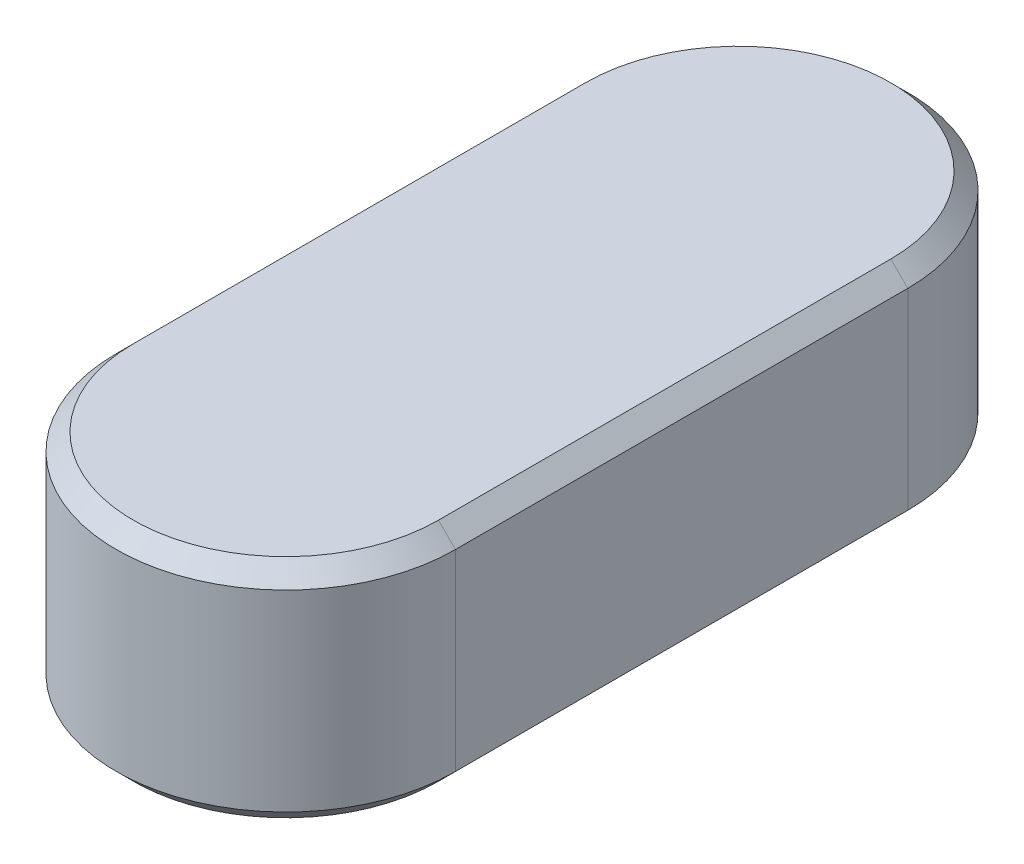
ISO-10303-21;
HEADER;
FILE_DESCRIPTION(('STEP AP214'),'2;1');
FILE_NAME('part.step','',(''),(''),'','','');
FILE_SCHEMA(('AUTOMOTIVE_DESIGN { 1 0 10303 214 1 1 1 1 }'));
ENDSEC;
DATA;
#1=APPLICATION_CONTEXT('core data for automotive mechanical design processes');
#2=APPLICATION_PROTOCOL_DEFINITION('international standard','automotive_design',2000,#1);
#3=PRODUCT_CONTEXT('',#1,'mechanical');
#4=PRODUCT('Part','Part','',(#3));
#5=PRODUCT_RELATED_PRODUCT_CATEGORY('part','',(#4));
#6=PRODUCT_DEFINITION_FORMATION('','',#4);
#7=PRODUCT_DEFINITION_CONTEXT('part definition',#1,'design');
#8=PRODUCT_DEFINITION('design','',#6,#7);
#9=PRODUCT_DEFINITION_SHAPE('','',#8);
#10=(LENGTH_UNIT() NAMED_UNIT(*) SI_UNIT(.MILLI.,.METRE.));
#11=(NAMED_UNIT(*) PLANE_ANGLE_UNIT() SI_UNIT($,.RADIAN.));
#12=(NAMED_UNIT(*) SI_UNIT($,.STERADIAN.) SOLID_ANGLE_UNIT());
#13=UNCERTAINTY_MEASURE_WITH_UNIT(LENGTH_MEASURE(1.E-05),#10,'distance_accuracy_value','');
#14=(GEOMETRIC_REPRESENTATION_CONTEXT(3) GLOBAL_UNCERTAINTY_ASSIGNED_CONTEXT((#13)) GLOBAL_UNIT_ASSIGNED_CONTEXT((#10,
#11,#12)) REPRESENTATION_CONTEXT('',''));
#15=CARTESIAN_POINT('',(0.,0.,0.));
#16=DIRECTION('',(0.,0.,1.));
#17=DIRECTION('',(1.,0.,0.));
#18=AXIS2_PLACEMENT_3D('',#15,#16,#17);
#19=CARTESIAN_POINT('',(0.,8.,0.));
#20=DIRECTION('',(0.,-1.,0.));
#21=DIRECTION('',(0.,0.,-1.));
#22=AXIS2_PLACEMENT_3D('',#19,#20,#21);
#23=CYLINDRICAL_SURFACE('',#22,6.);
#24=DIRECTION('',(0.,-1.,0.));
#25=VECTOR('',#24,1.);
#26=CARTESIAN_POINT('',(-6.,8.,0.));
#27=LINE('',#26,#25);
#28=CARTESIAN_POINT('',(-6.,7.4,0.));
#29=VERTEX_POINT('',#28);
#30=CARTESIAN_POINT('',(-6.,0.600000000000003,0.));
#31=VERTEX_POINT('',#30);
#32=EDGE_CURVE('E119',#29,#31,#27,.T.);
#33=ORIENTED_EDGE('',*,*,#32,.T.);
#34=CARTESIAN_POINT('',(0.,0.600000000000003,0.));
#35=DIRECTION('',(0.,-1.,0.));
#36=DIRECTION('',(0.,0.,-1.));
#37=AXIS2_PLACEMENT_3D('',#34,#35,#36);
#38=CIRCLE('',#37,6.);
#39=CARTESIAN_POINT('',(6.,0.600000000000003,0.));
#40=VERTEX_POINT('',#39);
#41=EDGE_CURVE('E126',#31,#40,#38,.F.);
#42=ORIENTED_EDGE('',*,*,#41,.T.);
#43=DIRECTION('',(0.,-1.,0.));
#44=VECTOR('',#43,1.);
#45=CARTESIAN_POINT('',(6.,8.,0.));
#46=LINE('',#45,#44);
#47=CARTESIAN_POINT('',(6.,7.4,0.));
#48=VERTEX_POINT('',#47);
#49=EDGE_CURVE('E121',#48,#40,#46,.T.);
#50=ORIENTED_EDGE('',*,*,#49,.F.);
#51=CARTESIAN_POINT('',(0.,7.4,0.));
#52=DIRECTION('',(0.,-1.,0.));
#53=DIRECTION('',(0.,0.,-1.));
#54=AXIS2_PLACEMENT_3D('',#51,#52,#53);
#55=CIRCLE('',#54,6.);
#56=EDGE_CURVE('E117',#48,#29,#55,.T.);
#57=ORIENTED_EDGE('',*,*,#56,.T.);
#58=EDGE_LOOP('',(#33,#42,#50,#57));
#59=FACE_BOUND('',#58,.T.);
#60=ADVANCED_FACE('F45',(#59),#23,.T.);
#61=CARTESIAN_POINT('',(6.,8.,0.));
#62=DIRECTION('',(-1.,0.,0.));
#63=DIRECTION('',(0.,0.,1.));
#64=AXIS2_PLACEMENT_3D('',#61,#62,#63);
#65=PLANE('',#64);
#66=ORIENTED_EDGE('',*,*,#49,.T.);
#67=DIRECTION('',(0.,0.,-1.));
#68=VECTOR('',#67,1.);
#69=CARTESIAN_POINT('',(6.,0.600000000000003,-16.));
#70=LINE('',#69,#68);
#71=CARTESIAN_POINT('',(6.,0.600000000000003,-16.));
#72=VERTEX_POINT('',#71);
#73=EDGE_CURVE('E192',#40,#72,#70,.T.);
#74=ORIENTED_EDGE('',*,*,#73,.T.);
#75=DIRECTION('',(0.,-1.,0.));
#76=VECTOR('',#75,1.);
#77=CARTESIAN_POINT('',(6.,8.,-16.));
#78=LINE('',#77,#76);
#79=CARTESIAN_POINT('',(6.,7.4,-16.));
#80=VERTEX_POINT('',#79);
#81=EDGE_CURVE('E233',#80,#72,#78,.T.);
#82=ORIENTED_EDGE('',*,*,#81,.F.);
#83=DIRECTION('',(0.,0.,1.));
#84=VECTOR('',#83,1.);
#85=CARTESIAN_POINT('',(6.,7.4,0.));
#86=LINE('',#85,#84);
#87=EDGE_CURVE('E214',#80,#48,#86,.T.);
#88=ORIENTED_EDGE('',*,*,#87,.T.);
#89=EDGE_LOOP('',(#66,#74,#82,#88));
#90=FACE_BOUND('',#89,.T.);
#91=ADVANCED_FACE('F235',(#90),#65,.F.);
#92=CARTESIAN_POINT('',(0.,8.,-16.));
#93=DIRECTION('',(0.,-1.,0.));
#94=DIRECTION('',(0.,0.,-1.));
#95=AXIS2_PLACEMENT_3D('',#92,#93,#94);
#96=CYLINDRICAL_SURFACE('',#95,6.);
#97=ORIENTED_EDGE('',*,*,#81,.T.);
#98=CARTESIAN_POINT('',(0.,0.600000000000003,-16.));
#99=DIRECTION('',(0.,-1.,0.));
#100=DIRECTION('',(0.,0.,-1.));
#101=AXIS2_PLACEMENT_3D('',#98,#99,#100);
#102=CIRCLE('',#101,6.);
#103=CARTESIAN_POINT('',(-6.,0.600000000000003,-16.));
#104=VERTEX_POINT('',#103);
#105=EDGE_CURVE('E187',#72,#104,#102,.F.);
#106=ORIENTED_EDGE('',*,*,#105,.T.);
#107=DIRECTION('',(0.,-1.,0.));
#108=VECTOR('',#107,1.);
#109=CARTESIAN_POINT('',(-6.,8.,-16.));
#110=LINE('',#109,#108);
#111=CARTESIAN_POINT('',(-6.,7.4,-16.));
#112=VERTEX_POINT('',#111);
#113=EDGE_CURVE('E139',#112,#104,#110,.T.);
#114=ORIENTED_EDGE('',*,*,#113,.F.);
#115=CARTESIAN_POINT('',(0.,7.4,-16.));
#116=DIRECTION('',(0.,-1.,0.));
#117=DIRECTION('',(0.,0.,-1.));
#118=AXIS2_PLACEMENT_3D('',#115,#116,#117);
#119=CIRCLE('',#118,6.);
#120=EDGE_CURVE('E209',#112,#80,#119,.T.);
#121=ORIENTED_EDGE('',*,*,#120,.T.);
#122=EDGE_LOOP('',(#97,#106,#114,#121));
#123=FACE_BOUND('',#122,.T.);
#124=ADVANCED_FACE('F232',(#123),#96,.T.);
#125=CARTESIAN_POINT('',(-6.,8.,0.));
#126=DIRECTION('',(1.,0.,0.));
#127=DIRECTION('',(0.,0.,-1.));
#128=AXIS2_PLACEMENT_3D('',#125,#126,#127);
#129=PLANE('',#128);
#130=ORIENTED_EDGE('',*,*,#113,.T.);
#131=DIRECTION('',(0.,0.,1.));
#132=VECTOR('',#131,1.);
#133=CARTESIAN_POINT('',(-6.,0.600000000000003,0.));
#134=LINE('',#133,#132);
#135=EDGE_CURVE('E137',#104,#31,#134,.T.);
#136=ORIENTED_EDGE('',*,*,#135,.T.);
#137=ORIENTED_EDGE('',*,*,#32,.F.);
#138=DIRECTION('',(0.,0.,-1.));
#139=VECTOR('',#138,1.);
#140=CARTESIAN_POINT('',(-6.,7.4,0.));
#141=LINE('',#140,#139);
#142=EDGE_CURVE('E134',#29,#112,#141,.T.);
#143=ORIENTED_EDGE('',*,*,#142,.T.);
#144=EDGE_LOOP('',(#130,#136,#137,#143));
#145=FACE_BOUND('',#144,.T.);
#146=ADVANCED_FACE('F133',(#145),#129,.F.);
#147=CARTESIAN_POINT('',(0.,8.,0.));
#148=DIRECTION('',(0.,-1.,0.));
#149=DIRECTION('',(0.,0.,-1.));
#150=AXIS2_PLACEMENT_3D('',#147,#148,#149);
#151=PLANE('',#150);
#152=CARTESIAN_POINT('',(0.,8.,-16.));
#153=DIRECTION('',(0.,-1.,0.));
#154=DIRECTION('',(0.,0.,-1.));
#155=AXIS2_PLACEMENT_3D('',#152,#153,#154);
#156=CIRCLE('',#155,5.4);
#157=CARTESIAN_POINT('',(5.4,8.,-16.));
#158=VERTEX_POINT('',#157);
#159=CARTESIAN_POINT('',(-5.4,8.,-16.));
#160=VERTEX_POINT('',#159);
#161=EDGE_CURVE('E71',#158,#160,#156,.F.);
#162=ORIENTED_EDGE('',*,*,#161,.T.);
#163=DIRECTION('',(0.,0.,1.));
#164=VECTOR('',#163,1.);
#165=CARTESIAN_POINT('',(-5.4,8.,0.));
#166=LINE('',#165,#164);
#167=CARTESIAN_POINT('',(-5.4,8.,0.));
#168=VERTEX_POINT('',#167);
#169=EDGE_CURVE('E11',#160,#168,#166,.T.);
#170=ORIENTED_EDGE('',*,*,#169,.T.);
#171=CARTESIAN_POINT('',(0.,8.,0.));
#172=DIRECTION('',(0.,-1.,0.));
#173=DIRECTION('',(0.,0.,-1.));
#174=AXIS2_PLACEMENT_3D('',#171,#172,#173);
#175=CIRCLE('',#174,5.4);
#176=CARTESIAN_POINT('',(5.4,8.,0.));
#177=VERTEX_POINT('',#176);
#178=EDGE_CURVE('E56',#168,#177,#175,.F.);
#179=ORIENTED_EDGE('',*,*,#178,.T.);
#180=DIRECTION('',(0.,0.,-1.));
#181=VECTOR('',#180,1.);
#182=CARTESIAN_POINT('',(5.4,8.,0.));
#183=LINE('',#182,#181);
#184=EDGE_CURVE('E219',#177,#158,#183,.T.);
#185=ORIENTED_EDGE('',*,*,#184,.T.);
#186=EDGE_LOOP('',(#162,#170,#179,#185));
#187=FACE_BOUND('',#186,.T.);
#188=ADVANCED_FACE('F225',(#187),#151,.F.);
#189=CARTESIAN_POINT('',(0.,0.,0.));
#190=DIRECTION('',(0.,-1.,0.));
#191=DIRECTION('',(0.,0.,-1.));
#192=AXIS2_PLACEMENT_3D('',#189,#190,#191);
#193=PLANE('',#192);
#194=CARTESIAN_POINT('',(0.,0.,0.));
#195=DIRECTION('',(0.,-1.,0.));
#196=DIRECTION('',(0.,0.,-1.));
#197=AXIS2_PLACEMENT_3D('',#194,#195,#196);
#198=CIRCLE('',#197,5.4);
#199=CARTESIAN_POINT('',(5.4,0.,0.));
#200=VERTEX_POINT('',#199);
#201=CARTESIAN_POINT('',(-5.4,0.,0.));
#202=VERTEX_POINT('',#201);
#203=EDGE_CURVE('E199',#200,#202,#198,.T.);
#204=ORIENTED_EDGE('',*,*,#203,.T.);
#205=DIRECTION('',(0.,0.,-1.));
#206=VECTOR('',#205,1.);
#207=CARTESIAN_POINT('',(-5.4,0.,-16.));
#208=LINE('',#207,#206);
#209=CARTESIAN_POINT('',(-5.4,0.,-16.));
#210=VERTEX_POINT('',#209);
#211=EDGE_CURVE('E127',#202,#210,#208,.T.);
#212=ORIENTED_EDGE('',*,*,#211,.T.);
#213=CARTESIAN_POINT('',(0.,0.,-16.));
#214=DIRECTION('',(0.,-1.,0.));
#215=DIRECTION('',(0.,0.,-1.));
#216=AXIS2_PLACEMENT_3D('',#213,#214,#215);
#217=CIRCLE('',#216,5.4);
#218=CARTESIAN_POINT('',(5.4,0.,-16.));
#219=VERTEX_POINT('',#218);
#220=EDGE_CURVE('E185',#210,#219,#217,.T.);
#221=ORIENTED_EDGE('',*,*,#220,.T.);
#222=DIRECTION('',(0.,0.,1.));
#223=VECTOR('',#222,1.);
#224=CARTESIAN_POINT('',(5.4,0.,0.));
#225=LINE('',#224,#223);
#226=EDGE_CURVE('E193',#219,#200,#225,.T.);
#227=ORIENTED_EDGE('',*,*,#226,.T.);
#228=EDGE_LOOP('',(#204,#212,#221,#227));
#229=FACE_BOUND('',#228,.T.);
#230=ADVANCED_FACE('F263',(#229),#193,.T.);
#231=CARTESIAN_POINT('',(6.,0.600000000000003,0.));
#232=DIRECTION('',(0.707106781186548,-0.707106781186548,0.));
#233=DIRECTION('',(0.,0.,1.));
#234=AXIS2_PLACEMENT_3D('',#231,#232,#233);
#235=PLANE('',#234);
#236=DIRECTION('',(0.707106781186548,0.707106781186548,0.));
#237=VECTOR('',#236,1.);
#238=CARTESIAN_POINT('',(5.4,0.,0.));
#239=LINE('',#238,#237);
#240=EDGE_CURVE('E169',#200,#40,#239,.T.);
#241=ORIENTED_EDGE('',*,*,#240,.F.);
#242=ORIENTED_EDGE('',*,*,#226,.F.);
#243=DIRECTION('',(-0.707106781186548,-0.707106781186548,0.));
#244=VECTOR('',#243,1.);
#245=CARTESIAN_POINT('',(6.,0.600000000000003,-16.));
#246=LINE('',#245,#244);
#247=EDGE_CURVE('E140',#72,#219,#246,.T.);
#248=ORIENTED_EDGE('',*,*,#247,.F.);
#249=ORIENTED_EDGE('',*,*,#73,.F.);
#250=EDGE_LOOP('',(#241,#242,#248,#249));
#251=FACE_BOUND('',#250,.T.);
#252=ADVANCED_FACE('F191',(#251),#235,.T.);
#253=CARTESIAN_POINT('',(0.,0.600000000000003,-16.));
#254=DIRECTION('',(0.,1.,0.));
#255=DIRECTION('',(0.,0.,1.));
#256=AXIS2_PLACEMENT_3D('',#253,#254,#255);
#257=CONICAL_SURFACE('',#256,6.,0.785398163397448);
#258=ORIENTED_EDGE('',*,*,#247,.T.);
#259=ORIENTED_EDGE('',*,*,#220,.F.);
#260=DIRECTION('',(0.707106781186548,-0.707106781186548,0.));
#261=VECTOR('',#260,1.);
#262=CARTESIAN_POINT('',(-6.,0.600000000000003,-16.));
#263=LINE('',#262,#261);
#264=EDGE_CURVE('E162',#104,#210,#263,.T.);
#265=ORIENTED_EDGE('',*,*,#264,.F.);
#266=ORIENTED_EDGE('',*,*,#105,.F.);
#267=EDGE_LOOP('',(#258,#259,#265,#266));
#268=FACE_BOUND('',#267,.T.);
#269=ADVANCED_FACE('F183',(#268),#257,.T.);
#270=CARTESIAN_POINT('',(0.,0.600000000000003,0.));
#271=DIRECTION('',(0.,1.,0.));
#272=DIRECTION('',(0.,0.,1.));
#273=AXIS2_PLACEMENT_3D('',#270,#271,#272);
#274=CONICAL_SURFACE('',#273,6.,0.785398163397448);
#275=ORIENTED_EDGE('',*,*,#240,.T.);
#276=ORIENTED_EDGE('',*,*,#41,.F.);
#277=DIRECTION('',(-0.707106781186548,0.707106781186548,0.));
#278=VECTOR('',#277,1.);
#279=CARTESIAN_POINT('',(-5.4,0.,0.));
#280=LINE('',#279,#278);
#281=EDGE_CURVE('E158',#202,#31,#280,.T.);
#282=ORIENTED_EDGE('',*,*,#281,.F.);
#283=ORIENTED_EDGE('',*,*,#203,.F.);
#284=EDGE_LOOP('',(#275,#276,#282,#283));
#285=FACE_BOUND('',#284,.T.);
#286=ADVANCED_FACE('F244',(#285),#274,.T.);
#287=CARTESIAN_POINT('',(-6.,0.600000000000003,0.));
#288=DIRECTION('',(-0.707106781186548,-0.707106781186548,0.));
#289=DIRECTION('',(0.,0.,-1.));
#290=AXIS2_PLACEMENT_3D('',#287,#288,#289);
#291=PLANE('',#290);
#292=ORIENTED_EDGE('',*,*,#264,.T.);
#293=ORIENTED_EDGE('',*,*,#211,.F.);
#294=ORIENTED_EDGE('',*,*,#281,.T.);
#295=ORIENTED_EDGE('',*,*,#135,.F.);
#296=EDGE_LOOP('',(#292,#293,#294,#295));
#297=FACE_BOUND('',#296,.T.);
#298=ADVANCED_FACE('F242',(#297),#291,.T.);
#299=CARTESIAN_POINT('',(5.4,8.,0.));
#300=DIRECTION('',(-0.707106781186547,-0.707106781186547,0.));
#301=DIRECTION('',(0.,0.,-1.));
#302=AXIS2_PLACEMENT_3D('',#299,#300,#301);
#303=PLANE('',#302);
#304=DIRECTION('',(-0.707106781186547,0.707106781186547,0.));
#305=VECTOR('',#304,1.);
#306=CARTESIAN_POINT('',(6.,7.4,0.));
#307=LINE('',#306,#305);
#308=EDGE_CURVE('E151',#48,#177,#307,.T.);
#309=ORIENTED_EDGE('',*,*,#308,.F.);
#310=ORIENTED_EDGE('',*,*,#87,.F.);
#311=DIRECTION('',(0.707106781186547,-0.707106781186547,0.));
#312=VECTOR('',#311,1.);
#313=CARTESIAN_POINT('',(5.4,8.,-16.));
#314=LINE('',#313,#312);
#315=EDGE_CURVE('E50',#158,#80,#314,.T.);
#316=ORIENTED_EDGE('',*,*,#315,.F.);
#317=ORIENTED_EDGE('',*,*,#184,.F.);
#318=EDGE_LOOP('',(#309,#310,#316,#317));
#319=FACE_BOUND('',#318,.T.);
#320=ADVANCED_FACE('F48',(#319),#303,.F.);
#321=CARTESIAN_POINT('',(0.,8.,-16.));
#322=DIRECTION('',(0.,-1.,0.));
#323=DIRECTION('',(0.,0.,-1.));
#324=AXIS2_PLACEMENT_3D('',#321,#322,#323);
#325=CONICAL_SURFACE('',#324,5.4,0.785398163397448);
#326=ORIENTED_EDGE('',*,*,#315,.T.);
#327=ORIENTED_EDGE('',*,*,#120,.F.);
#328=DIRECTION('',(-0.707106781186547,-0.707106781186547,0.));
#329=VECTOR('',#328,1.);
#330=CARTESIAN_POINT('',(-5.4,8.,-16.));
#331=LINE('',#330,#329);
#332=EDGE_CURVE('E143',#160,#112,#331,.T.);
#333=ORIENTED_EDGE('',*,*,#332,.F.);
#334=ORIENTED_EDGE('',*,*,#161,.F.);
#335=EDGE_LOOP('',(#326,#327,#333,#334));
#336=FACE_BOUND('',#335,.T.);
#337=ADVANCED_FACE('F228',(#336),#325,.T.);
#338=CARTESIAN_POINT('',(0.,8.,0.));
#339=DIRECTION('',(0.,-1.,0.));
#340=DIRECTION('',(0.,0.,-1.));
#341=AXIS2_PLACEMENT_3D('',#338,#339,#340);
#342=CONICAL_SURFACE('',#341,5.4,0.785398163397448);
#343=ORIENTED_EDGE('',*,*,#308,.T.);
#344=ORIENTED_EDGE('',*,*,#178,.F.);
#345=DIRECTION('',(0.707106781186547,0.707106781186547,0.));
#346=VECTOR('',#345,1.);
#347=CARTESIAN_POINT('',(-6.,7.4,0.));
#348=LINE('',#347,#346);
#349=EDGE_CURVE('E64',#29,#168,#348,.T.);
#350=ORIENTED_EDGE('',*,*,#349,.F.);
#351=ORIENTED_EDGE('',*,*,#56,.F.);
#352=EDGE_LOOP('',(#343,#344,#350,#351));
#353=FACE_BOUND('',#352,.T.);
#354=ADVANCED_FACE('F147',(#353),#342,.T.);
#355=CARTESIAN_POINT('',(-5.4,8.,0.));
#356=DIRECTION('',(0.707106781186547,-0.707106781186547,0.));
#357=DIRECTION('',(0.,0.,1.));
#358=AXIS2_PLACEMENT_3D('',#355,#356,#357);
#359=PLANE('',#358);
#360=ORIENTED_EDGE('',*,*,#332,.T.);
#361=ORIENTED_EDGE('',*,*,#142,.F.);
#362=ORIENTED_EDGE('',*,*,#349,.T.);
#363=ORIENTED_EDGE('',*,*,#169,.F.);
#364=EDGE_LOOP('',(#360,#361,#362,#363));
#365=FACE_BOUND('',#364,.T.);
#366=ADVANCED_FACE('F142',(#365),#359,.F.);
#367=CLOSED_SHELL('',(#60,#91,#124,#146,#188,#230,#252,#269,#286,#298,#320,#337,#354,#366));
#368=MANIFOLD_SOLID_BREP('B2',#367);
#369=ADVANCED_BREP_SHAPE_REPRESENTATION('',(#18,#368),#14);
#370=SHAPE_DEFINITION_REPRESENTATION(#9,#369);
ENDSEC;
END-ISO-10303-21;
